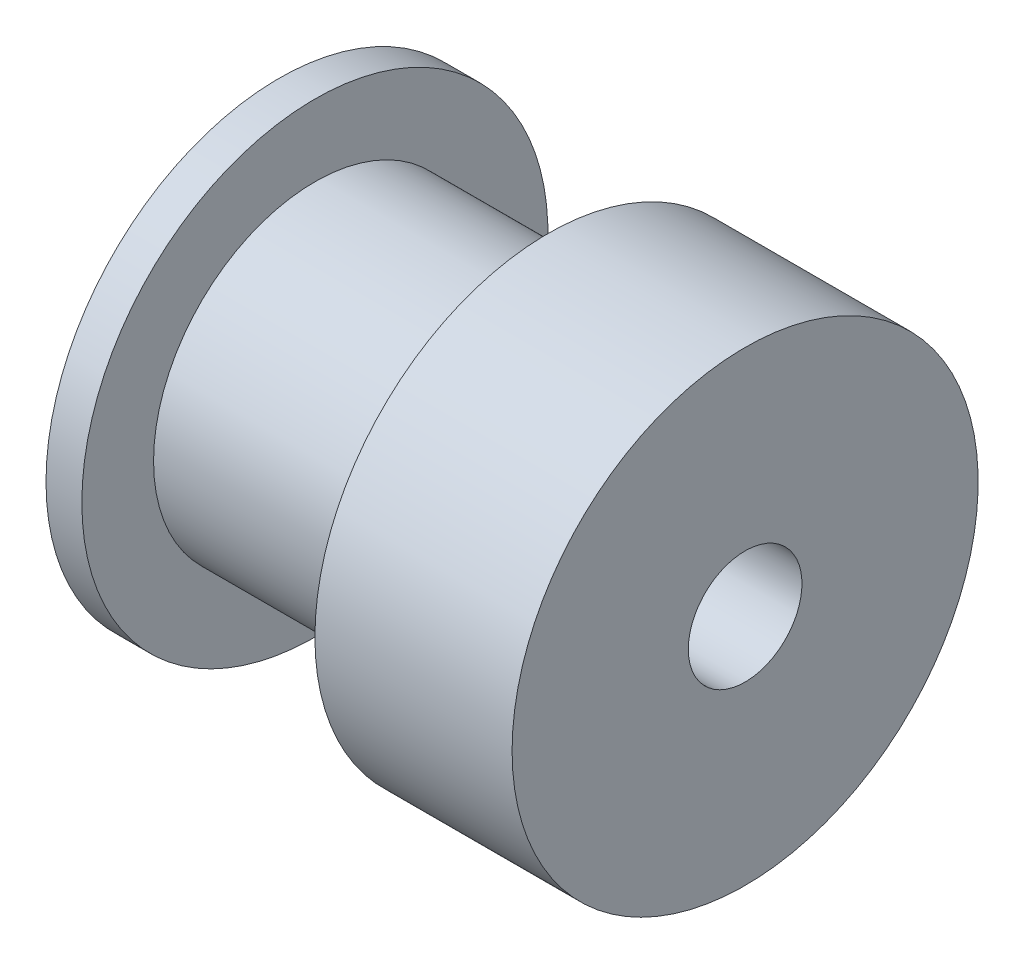
ISO-10303-21;
HEADER;
FILE_DESCRIPTION(('STEP AP214'),'2;1');
FILE_NAME('part.step','',(''),(''),'','','');
FILE_SCHEMA(('AUTOMOTIVE_DESIGN { 1 0 10303 214 1 1 1 1 }'));
ENDSEC;
DATA;
#1=APPLICATION_CONTEXT('core data for automotive mechanical design processes');
#2=APPLICATION_PROTOCOL_DEFINITION('international standard','automotive_design',2000,#1);
#3=PRODUCT_CONTEXT('',#1,'mechanical');
#4=PRODUCT('Part','Part','',(#3));
#5=PRODUCT_RELATED_PRODUCT_CATEGORY('part','',(#4));
#6=PRODUCT_DEFINITION_FORMATION('','',#4);
#7=PRODUCT_DEFINITION_CONTEXT('part definition',#1,'design');
#8=PRODUCT_DEFINITION('design','',#6,#7);
#9=PRODUCT_DEFINITION_SHAPE('','',#8);
#10=(LENGTH_UNIT() NAMED_UNIT(*) SI_UNIT(.MILLI.,.METRE.));
#11=(NAMED_UNIT(*) PLANE_ANGLE_UNIT() SI_UNIT($,.RADIAN.));
#12=(NAMED_UNIT(*) SI_UNIT($,.STERADIAN.) SOLID_ANGLE_UNIT());
#13=UNCERTAINTY_MEASURE_WITH_UNIT(LENGTH_MEASURE(1.E-05),#10,'distance_accuracy_value','');
#14=(GEOMETRIC_REPRESENTATION_CONTEXT(3) GLOBAL_UNCERTAINTY_ASSIGNED_CONTEXT((#13)) GLOBAL_UNIT_ASSIGNED_CONTEXT((#10,
#11,#12)) REPRESENTATION_CONTEXT('',''));
#15=CARTESIAN_POINT('',(0.,0.,0.));
#16=DIRECTION('',(0.,0.,1.));
#17=DIRECTION('',(1.,0.,0.));
#18=AXIS2_PLACEMENT_3D('',#15,#16,#17);
#19=CARTESIAN_POINT('',(6.5,3.25,0.));
#20=DIRECTION('',(-1.,0.,0.));
#21=DIRECTION('',(0.,0.,1.));
#22=AXIS2_PLACEMENT_3D('',#19,#20,#21);
#23=PLANE('',#22);
#24=CARTESIAN_POINT('',(6.5,-3.25,0.));
#25=DIRECTION('',(-1.,0.,0.));
#26=DIRECTION('',(0.,0.,1.));
#27=AXIS2_PLACEMENT_3D('',#24,#25,#26);
#28=CIRCLE('',#27,1.585);
#29=CARTESIAN_POINT('',(6.5,-3.25,1.585));
#30=VERTEX_POINT('',#29);
#31=EDGE_CURVE('E64',#30,#30,#28,.T.);
#32=ORIENTED_EDGE('',*,*,#31,.T.);
#33=EDGE_LOOP('',(#32));
#34=FACE_BOUND('',#33,.T.);
#35=CARTESIAN_POINT('',(6.5,-3.25,0.));
#36=DIRECTION('',(-1.,0.,0.));
#37=DIRECTION('',(0.,0.,1.));
#38=AXIS2_PLACEMENT_3D('',#35,#36,#37);
#39=CIRCLE('',#38,6.5);
#40=CARTESIAN_POINT('',(6.5,-3.25,6.5));
#41=VERTEX_POINT('',#40);
#42=EDGE_CURVE('E61',#41,#41,#39,.T.);
#43=ORIENTED_EDGE('',*,*,#42,.F.);
#44=EDGE_LOOP('',(#43));
#45=FACE_BOUND('',#44,.T.);
#46=ADVANCED_FACE('F39',(#34,#45),#23,.F.);
#47=CARTESIAN_POINT('',(-6.5,3.25,0.));
#48=DIRECTION('',(1.,0.,0.));
#49=DIRECTION('',(0.,0.,-1.));
#50=AXIS2_PLACEMENT_3D('',#47,#48,#49);
#51=PLANE('',#50);
#52=CARTESIAN_POINT('',(-6.5,-3.25,0.));
#53=DIRECTION('',(-1.,0.,0.));
#54=DIRECTION('',(0.,0.,1.));
#55=AXIS2_PLACEMENT_3D('',#52,#53,#54);
#56=CIRCLE('',#55,1.585);
#57=CARTESIAN_POINT('',(-6.5,-3.25,1.585));
#58=VERTEX_POINT('',#57);
#59=EDGE_CURVE('E65',#58,#58,#56,.T.);
#60=ORIENTED_EDGE('',*,*,#59,.F.);
#61=EDGE_LOOP('',(#60));
#62=FACE_BOUND('',#61,.T.);
#63=CARTESIAN_POINT('',(-6.5,-3.25,0.));
#64=DIRECTION('',(-1.,0.,0.));
#65=DIRECTION('',(0.,0.,1.));
#66=AXIS2_PLACEMENT_3D('',#63,#64,#65);
#67=CIRCLE('',#66,6.5);
#68=CARTESIAN_POINT('',(-6.5,-3.25,6.5));
#69=VERTEX_POINT('',#68);
#70=EDGE_CURVE('E10',#69,#69,#67,.T.);
#71=ORIENTED_EDGE('',*,*,#70,.T.);
#72=EDGE_LOOP('',(#71));
#73=FACE_BOUND('',#72,.T.);
#74=ADVANCED_FACE('F80',(#62,#73),#51,.F.);
#75=CARTESIAN_POINT('',(-6.5,-3.25,0.));
#76=DIRECTION('',(-1.,0.,0.));
#77=DIRECTION('',(0.,0.,1.));
#78=AXIS2_PLACEMENT_3D('',#75,#76,#77);
#79=CYLINDRICAL_SURFACE('',#78,6.5);
#80=ORIENTED_EDGE('',*,*,#70,.F.);
#81=EDGE_LOOP('',(#80));
#82=FACE_BOUND('',#81,.T.);
#83=CARTESIAN_POINT('',(-5.5,-3.25,0.));
#84=DIRECTION('',(-1.,0.,0.));
#85=DIRECTION('',(0.,0.,1.));
#86=AXIS2_PLACEMENT_3D('',#83,#84,#85);
#87=CIRCLE('',#86,6.5);
#88=CARTESIAN_POINT('',(-5.5,-3.25,6.5));
#89=VERTEX_POINT('',#88);
#90=EDGE_CURVE('E45',#89,#89,#87,.T.);
#91=ORIENTED_EDGE('',*,*,#90,.T.);
#92=EDGE_LOOP('',(#91));
#93=FACE_BOUND('',#92,.T.);
#94=ADVANCED_FACE('F82',(#82,#93),#79,.T.);
#95=CARTESIAN_POINT('',(-5.5,3.25,0.));
#96=DIRECTION('',(-1.,0.,0.));
#97=DIRECTION('',(0.,0.,1.));
#98=AXIS2_PLACEMENT_3D('',#95,#96,#97);
#99=PLANE('',#98);
#100=ORIENTED_EDGE('',*,*,#90,.F.);
#101=EDGE_LOOP('',(#100));
#102=FACE_BOUND('',#101,.T.);
#103=CARTESIAN_POINT('',(-5.5,-3.25,0.));
#104=DIRECTION('',(-1.,0.,0.));
#105=DIRECTION('',(0.,0.,1.));
#106=AXIS2_PLACEMENT_3D('',#103,#104,#105);
#107=CIRCLE('',#106,4.5);
#108=CARTESIAN_POINT('',(-5.5,-3.25,4.5));
#109=VERTEX_POINT('',#108);
#110=EDGE_CURVE('E49',#109,#109,#107,.T.);
#111=ORIENTED_EDGE('',*,*,#110,.T.);
#112=EDGE_LOOP('',(#111));
#113=FACE_BOUND('',#112,.T.);
#114=ADVANCED_FACE('F87',(#102,#113),#99,.F.);
#115=CARTESIAN_POINT('',(-6.5,-3.25,0.));
#116=DIRECTION('',(-1.,0.,0.));
#117=DIRECTION('',(0.,0.,1.));
#118=AXIS2_PLACEMENT_3D('',#115,#116,#117);
#119=CYLINDRICAL_SURFACE('',#118,4.5);
#120=ORIENTED_EDGE('',*,*,#110,.F.);
#121=EDGE_LOOP('',(#120));
#122=FACE_BOUND('',#121,.T.);
#123=CARTESIAN_POINT('',(0.999999999999999,-3.25,0.));
#124=DIRECTION('',(-1.,0.,0.));
#125=DIRECTION('',(0.,0.,1.));
#126=AXIS2_PLACEMENT_3D('',#123,#124,#125);
#127=CIRCLE('',#126,4.5);
#128=CARTESIAN_POINT('',(0.999999999999999,-3.25,4.5));
#129=VERTEX_POINT('',#128);
#130=EDGE_CURVE('E53',#129,#129,#127,.T.);
#131=ORIENTED_EDGE('',*,*,#130,.T.);
#132=EDGE_LOOP('',(#131));
#133=FACE_BOUND('',#132,.T.);
#134=ADVANCED_FACE('F93',(#122,#133),#119,.T.);
#135=CARTESIAN_POINT('',(0.999999999999999,1.25,0.));
#136=DIRECTION('',(1.,0.,0.));
#137=DIRECTION('',(0.,0.,-1.));
#138=AXIS2_PLACEMENT_3D('',#135,#136,#137);
#139=PLANE('',#138);
#140=ORIENTED_EDGE('',*,*,#130,.F.);
#141=EDGE_LOOP('',(#140));
#142=FACE_BOUND('',#141,.T.);
#143=CARTESIAN_POINT('',(0.999999999999999,-3.25,0.));
#144=DIRECTION('',(-1.,0.,0.));
#145=DIRECTION('',(0.,0.,1.));
#146=AXIS2_PLACEMENT_3D('',#143,#144,#145);
#147=CIRCLE('',#146,6.5);
#148=CARTESIAN_POINT('',(0.999999999999999,-3.25,6.5));
#149=VERTEX_POINT('',#148);
#150=EDGE_CURVE('E58',#149,#149,#147,.T.);
#151=ORIENTED_EDGE('',*,*,#150,.T.);
#152=EDGE_LOOP('',(#151));
#153=FACE_BOUND('',#152,.T.);
#154=ADVANCED_FACE('F97',(#142,#153),#139,.F.);
#155=CARTESIAN_POINT('',(-6.5,-3.25,0.));
#156=DIRECTION('',(-1.,0.,0.));
#157=DIRECTION('',(0.,0.,1.));
#158=AXIS2_PLACEMENT_3D('',#155,#156,#157);
#159=CYLINDRICAL_SURFACE('',#158,6.5);
#160=ORIENTED_EDGE('',*,*,#150,.F.);
#161=EDGE_LOOP('',(#160));
#162=FACE_BOUND('',#161,.T.);
#163=ORIENTED_EDGE('',*,*,#42,.T.);
#164=EDGE_LOOP('',(#163));
#165=FACE_BOUND('',#164,.T.);
#166=ADVANCED_FACE('F76',(#162,#165),#159,.T.);
#167=CARTESIAN_POINT('',(6.5,-3.25,0.));
#168=DIRECTION('',(-1.,0.,0.));
#169=DIRECTION('',(0.,0.,1.));
#170=AXIS2_PLACEMENT_3D('',#167,#168,#169);
#171=CYLINDRICAL_SURFACE('',#170,1.585);
#172=ORIENTED_EDGE('',*,*,#31,.F.);
#173=EDGE_LOOP('',(#172));
#174=FACE_BOUND('',#173,.T.);
#175=ORIENTED_EDGE('',*,*,#59,.T.);
#176=EDGE_LOOP('',(#175));
#177=FACE_BOUND('',#176,.T.);
#178=ADVANCED_FACE('F73',(#174,#177),#171,.F.);
#179=CLOSED_SHELL('',(#46,#74,#94,#114,#134,#154,#166,#178));
#180=MANIFOLD_SOLID_BREP('B2',#179);
#181=ADVANCED_BREP_SHAPE_REPRESENTATION('',(#18,#180),#14);
#182=SHAPE_DEFINITION_REPRESENTATION(#9,#181);
ENDSEC;
END-ISO-10303-21;
